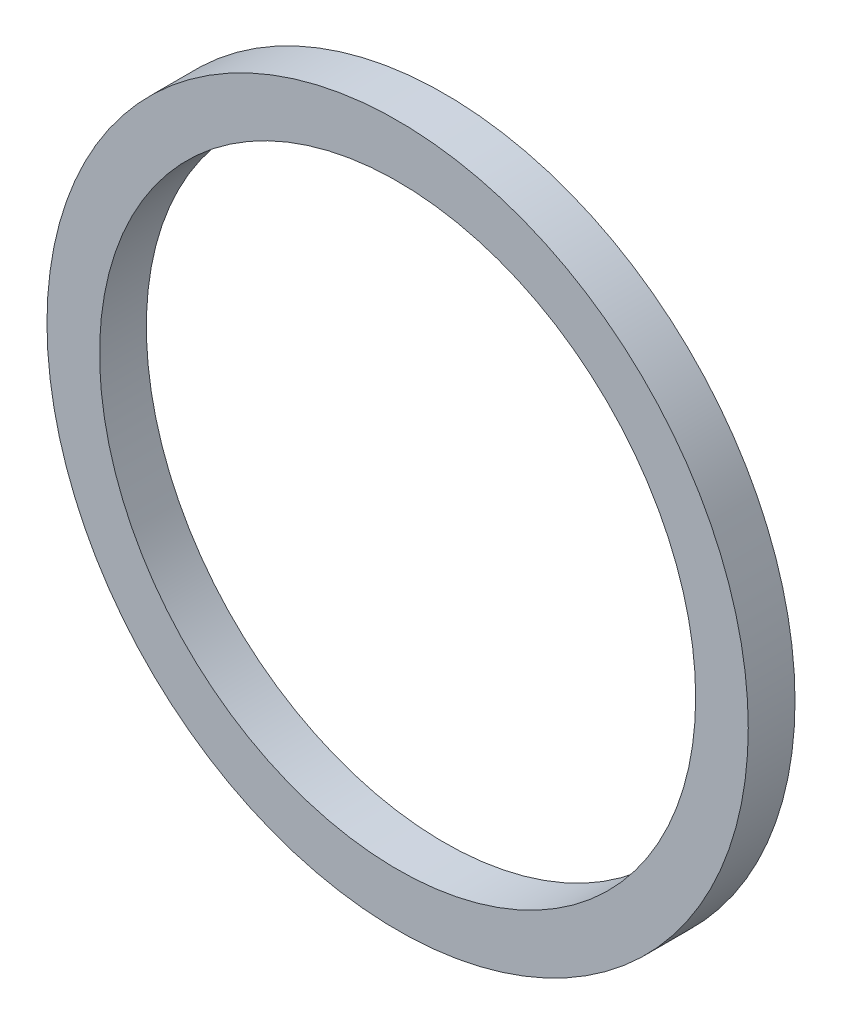
ISO-10303-21;
HEADER;
FILE_DESCRIPTION(('STEP AP214'),'2;1');
FILE_NAME('part.step','',(''),(''),'','','');
FILE_SCHEMA(('AUTOMOTIVE_DESIGN { 1 0 10303 214 1 1 1 1 }'));
ENDSEC;
DATA;
#1=APPLICATION_CONTEXT('core data for automotive mechanical design processes');
#2=APPLICATION_PROTOCOL_DEFINITION('international standard','automotive_design',2000,#1);
#3=PRODUCT_CONTEXT('',#1,'mechanical');
#4=PRODUCT('Part','Part','',(#3));
#5=PRODUCT_RELATED_PRODUCT_CATEGORY('part','',(#4));
#6=PRODUCT_DEFINITION_FORMATION('','',#4);
#7=PRODUCT_DEFINITION_CONTEXT('part definition',#1,'design');
#8=PRODUCT_DEFINITION('design','',#6,#7);
#9=PRODUCT_DEFINITION_SHAPE('','',#8);
#10=(LENGTH_UNIT() NAMED_UNIT(*) SI_UNIT(.MILLI.,.METRE.));
#11=(NAMED_UNIT(*) PLANE_ANGLE_UNIT() SI_UNIT($,.RADIAN.));
#12=(NAMED_UNIT(*) SI_UNIT($,.STERADIAN.) SOLID_ANGLE_UNIT());
#13=UNCERTAINTY_MEASURE_WITH_UNIT(LENGTH_MEASURE(1.E-05),#10,'distance_accuracy_value','');
#14=(GEOMETRIC_REPRESENTATION_CONTEXT(3) GLOBAL_UNCERTAINTY_ASSIGNED_CONTEXT((#13)) GLOBAL_UNIT_ASSIGNED_CONTEXT((#10,
#11,#12)) REPRESENTATION_CONTEXT('',''));
#15=CARTESIAN_POINT('',(0.,0.,0.));
#16=DIRECTION('',(0.,0.,1.));
#17=DIRECTION('',(1.,0.,0.));
#18=AXIS2_PLACEMENT_3D('',#15,#16,#17);
#19=CARTESIAN_POINT('',(0.,0.,2.));
#20=DIRECTION('',(0.,0.,-1.));
#21=DIRECTION('',(-1.,0.,0.));
#22=AXIS2_PLACEMENT_3D('',#19,#20,#21);
#23=CYLINDRICAL_SURFACE('',#22,12.75);
#24=CARTESIAN_POINT('',(0.,0.,2.));
#25=DIRECTION('',(0.,0.,1.));
#26=DIRECTION('',(1.,0.,0.));
#27=AXIS2_PLACEMENT_3D('',#24,#25,#26);
#28=CIRCLE('',#27,12.75);
#29=CARTESIAN_POINT('',(12.75,0.,2.));
#30=VERTEX_POINT('',#29);
#31=EDGE_CURVE('E39',#30,#30,#28,.T.);
#32=ORIENTED_EDGE('',*,*,#31,.T.);
#33=EDGE_LOOP('',(#32));
#34=FACE_BOUND('',#33,.T.);
#35=CARTESIAN_POINT('',(0.,0.,0.));
#36=DIRECTION('',(0.,0.,1.));
#37=DIRECTION('',(1.,0.,0.));
#38=AXIS2_PLACEMENT_3D('',#35,#36,#37);
#39=CIRCLE('',#38,12.75);
#40=CARTESIAN_POINT('',(12.75,0.,0.));
#41=VERTEX_POINT('',#40);
#42=EDGE_CURVE('E45',#41,#41,#39,.T.);
#43=ORIENTED_EDGE('',*,*,#42,.F.);
#44=EDGE_LOOP('',(#43));
#45=FACE_BOUND('',#44,.T.);
#46=ADVANCED_FACE('F32',(#34,#45),#23,.F.);
#47=CARTESIAN_POINT('',(0.,0.,2.));
#48=DIRECTION('',(0.,0.,-1.));
#49=DIRECTION('',(-1.,0.,0.));
#50=AXIS2_PLACEMENT_3D('',#47,#48,#49);
#51=CYLINDRICAL_SURFACE('',#50,15.);
#52=CARTESIAN_POINT('',(0.,0.,2.));
#53=DIRECTION('',(0.,0.,1.));
#54=DIRECTION('',(1.,0.,0.));
#55=AXIS2_PLACEMENT_3D('',#52,#53,#54);
#56=CIRCLE('',#55,15.);
#57=CARTESIAN_POINT('',(15.,0.,2.));
#58=VERTEX_POINT('',#57);
#59=EDGE_CURVE('E10',#58,#58,#56,.T.);
#60=ORIENTED_EDGE('',*,*,#59,.F.);
#61=EDGE_LOOP('',(#60));
#62=FACE_BOUND('',#61,.T.);
#63=CARTESIAN_POINT('',(0.,0.,0.));
#64=DIRECTION('',(0.,0.,1.));
#65=DIRECTION('',(1.,0.,0.));
#66=AXIS2_PLACEMENT_3D('',#63,#64,#65);
#67=CIRCLE('',#66,15.);
#68=CARTESIAN_POINT('',(15.,0.,0.));
#69=VERTEX_POINT('',#68);
#70=EDGE_CURVE('E35',#69,#69,#67,.T.);
#71=ORIENTED_EDGE('',*,*,#70,.T.);
#72=EDGE_LOOP('',(#71));
#73=FACE_BOUND('',#72,.T.);
#74=ADVANCED_FACE('F52',(#62,#73),#51,.T.);
#75=CARTESIAN_POINT('',(0.,0.,2.));
#76=DIRECTION('',(0.,0.,1.));
#77=DIRECTION('',(1.,0.,0.));
#78=AXIS2_PLACEMENT_3D('',#75,#76,#77);
#79=PLANE('',#78);
#80=ORIENTED_EDGE('',*,*,#31,.F.);
#81=EDGE_LOOP('',(#80));
#82=FACE_BOUND('',#81,.T.);
#83=ORIENTED_EDGE('',*,*,#59,.T.);
#84=EDGE_LOOP('',(#83));
#85=FACE_BOUND('',#84,.T.);
#86=ADVANCED_FACE('F56',(#82,#85),#79,.T.);
#87=CARTESIAN_POINT('',(0.,0.,0.));
#88=DIRECTION('',(0.,0.,1.));
#89=DIRECTION('',(1.,0.,0.));
#90=AXIS2_PLACEMENT_3D('',#87,#88,#89);
#91=PLANE('',#90);
#92=ORIENTED_EDGE('',*,*,#42,.T.);
#93=EDGE_LOOP('',(#92));
#94=FACE_BOUND('',#93,.T.);
#95=ORIENTED_EDGE('',*,*,#70,.F.);
#96=EDGE_LOOP('',(#95));
#97=FACE_BOUND('',#96,.T.);
#98=ADVANCED_FACE('F54',(#94,#97),#91,.F.);
#99=CLOSED_SHELL('',(#46,#74,#86,#98));
#100=MANIFOLD_SOLID_BREP('B2',#99);
#101=ADVANCED_BREP_SHAPE_REPRESENTATION('',(#18,#100),#14);
#102=SHAPE_DEFINITION_REPRESENTATION(#9,#101);
ENDSEC;
END-ISO-10303-21;
